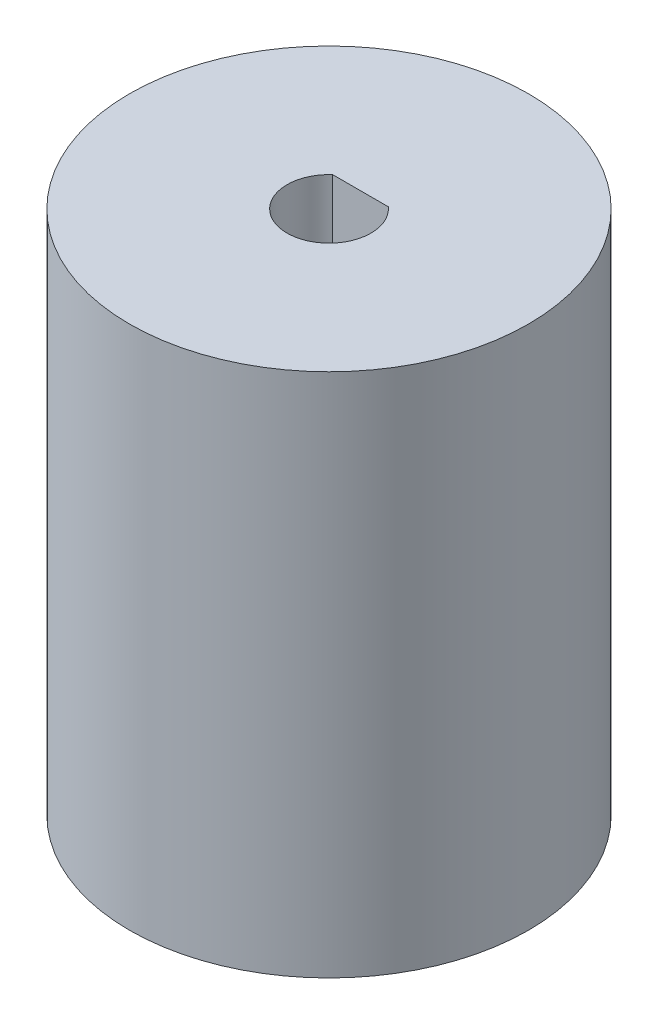
ISO-10303-21;
HEADER;
FILE_DESCRIPTION(('STEP AP214'),'2;1');
FILE_NAME('part.step','',(''),(''),'','','');
FILE_SCHEMA(('AUTOMOTIVE_DESIGN { 1 0 10303 214 1 1 1 1 }'));
ENDSEC;
DATA;
#1=APPLICATION_CONTEXT('core data for automotive mechanical design processes');
#2=APPLICATION_PROTOCOL_DEFINITION('international standard','automotive_design',2000,#1);
#3=PRODUCT_CONTEXT('',#1,'mechanical');
#4=PRODUCT('Part','Part','',(#3));
#5=PRODUCT_RELATED_PRODUCT_CATEGORY('part','',(#4));
#6=PRODUCT_DEFINITION_FORMATION('','',#4);
#7=PRODUCT_DEFINITION_CONTEXT('part definition',#1,'design');
#8=PRODUCT_DEFINITION('design','',#6,#7);
#9=PRODUCT_DEFINITION_SHAPE('','',#8);
#10=(LENGTH_UNIT() NAMED_UNIT(*) SI_UNIT(.MILLI.,.METRE.));
#11=(NAMED_UNIT(*) PLANE_ANGLE_UNIT() SI_UNIT($,.RADIAN.));
#12=(NAMED_UNIT(*) SI_UNIT($,.STERADIAN.) SOLID_ANGLE_UNIT());
#13=UNCERTAINTY_MEASURE_WITH_UNIT(LENGTH_MEASURE(1.E-05),#10,'distance_accuracy_value','');
#14=(GEOMETRIC_REPRESENTATION_CONTEXT(3) GLOBAL_UNCERTAINTY_ASSIGNED_CONTEXT((#13)) GLOBAL_UNIT_ASSIGNED_CONTEXT((#10,
#11,#12)) REPRESENTATION_CONTEXT('',''));
#15=CARTESIAN_POINT('',(0.,0.,0.));
#16=DIRECTION('',(0.,0.,1.));
#17=DIRECTION('',(1.,0.,0.));
#18=AXIS2_PLACEMENT_3D('',#15,#16,#17);
#19=CARTESIAN_POINT('',(-9.5,0.,0.));
#20=DIRECTION('',(0.,-1.,0.));
#21=DIRECTION('',(1.,0.,0.));
#22=AXIS2_PLACEMENT_3D('',#19,#20,#21);
#23=PLANE('',#22);
#24=CARTESIAN_POINT('',(0.,0.,0.));
#25=DIRECTION('',(0.,1.,0.));
#26=DIRECTION('',(-1.,0.,0.));
#27=AXIS2_PLACEMENT_3D('',#24,#25,#26);
#28=CIRCLE('',#27,4.);
#29=CARTESIAN_POINT('',(-4.,0.,0.));
#30=VERTEX_POINT('',#29);
#31=EDGE_CURVE('E11',#30,#30,#28,.T.);
#32=ORIENTED_EDGE('',*,*,#31,.T.);
#33=EDGE_LOOP('',(#32));
#34=FACE_BOUND('',#33,.T.);
#35=CARTESIAN_POINT('',(0.,0.,0.));
#36=DIRECTION('',(0.,1.,0.));
#37=DIRECTION('',(-1.,0.,0.));
#38=AXIS2_PLACEMENT_3D('',#35,#36,#37);
#39=CIRCLE('',#38,9.5);
#40=CARTESIAN_POINT('',(-9.5,0.,0.));
#41=VERTEX_POINT('',#40);
#42=EDGE_CURVE('E70',#41,#41,#39,.T.);
#43=ORIENTED_EDGE('',*,*,#42,.F.);
#44=EDGE_LOOP('',(#43));
#45=FACE_BOUND('',#44,.T.);
#46=ADVANCED_FACE('F33',(#34,#45),#23,.T.);
#47=CARTESIAN_POINT('',(0.,0.,0.));
#48=DIRECTION('',(0.,1.,0.));
#49=DIRECTION('',(-1.,0.,0.));
#50=AXIS2_PLACEMENT_3D('',#47,#48,#49);
#51=CYLINDRICAL_SURFACE('',#50,4.);
#52=CARTESIAN_POINT('',(0.,18.,0.));
#53=DIRECTION('',(0.,1.,0.));
#54=DIRECTION('',(-1.,0.,0.));
#55=AXIS2_PLACEMENT_3D('',#52,#53,#54);
#56=CIRCLE('',#55,4.);
#57=CARTESIAN_POINT('',(-4.,18.,0.));
#58=VERTEX_POINT('',#57);
#59=EDGE_CURVE('E40',#58,#58,#56,.T.);
#60=ORIENTED_EDGE('',*,*,#59,.T.);
#61=EDGE_LOOP('',(#60));
#62=FACE_BOUND('',#61,.T.);
#63=ORIENTED_EDGE('',*,*,#31,.F.);
#64=EDGE_LOOP('',(#63));
#65=FACE_BOUND('',#64,.T.);
#66=ADVANCED_FACE('F85',(#62,#65),#51,.F.);
#67=CARTESIAN_POINT('',(-4.,18.,0.));
#68=DIRECTION('',(0.,-1.,0.));
#69=DIRECTION('',(1.,0.,0.));
#70=AXIS2_PLACEMENT_3D('',#67,#68,#69);
#71=PLANE('',#70);
#72=CARTESIAN_POINT('',(0.,18.,0.));
#73=DIRECTION('',(0.,1.,0.));
#74=DIRECTION('',(-1.,0.,0.));
#75=AXIS2_PLACEMENT_3D('',#72,#73,#74);
#76=CIRCLE('',#75,2.);
#77=CARTESIAN_POINT('',(-1.3228756555323,18.,-1.5));
#78=VERTEX_POINT('',#77);
#79=CARTESIAN_POINT('',(1.32287565553229,18.,-1.5));
#80=VERTEX_POINT('',#79);
#81=EDGE_CURVE('E47',#78,#80,#76,.T.);
#82=ORIENTED_EDGE('',*,*,#81,.T.);
#83=DIRECTION('',(1.,0.,0.));
#84=VECTOR('',#83,1.);
#85=CARTESIAN_POINT('',(-1.3228756555323,18.,-1.5));
#86=LINE('',#85,#84);
#87=EDGE_CURVE('E73',#78,#80,#86,.T.);
#88=ORIENTED_EDGE('',*,*,#87,.F.);
#89=EDGE_LOOP('',(#82,#88));
#90=FACE_BOUND('',#89,.T.);
#91=ORIENTED_EDGE('',*,*,#59,.F.);
#92=EDGE_LOOP('',(#91));
#93=FACE_BOUND('',#92,.T.);
#94=ADVANCED_FACE('F88',(#90,#93),#71,.T.);
#95=CARTESIAN_POINT('',(0.,0.,0.));
#96=DIRECTION('',(0.,1.,0.));
#97=DIRECTION('',(-1.,0.,0.));
#98=AXIS2_PLACEMENT_3D('',#95,#96,#97);
#99=CYLINDRICAL_SURFACE('',#98,2.);
#100=DIRECTION('',(0.,1.,0.));
#101=VECTOR('',#100,1.);
#102=CARTESIAN_POINT('',(1.3228756555323,15.3074175964327,-1.5));
#103=LINE('',#102,#101);
#104=CARTESIAN_POINT('',(1.32287565553229,25.,-1.5));
#105=VERTEX_POINT('',#104);
#106=EDGE_CURVE('E52',#80,#105,#103,.T.);
#107=ORIENTED_EDGE('',*,*,#106,.F.);
#108=ORIENTED_EDGE('',*,*,#81,.F.);
#109=DIRECTION('',(0.,1.,0.));
#110=VECTOR('',#109,1.);
#111=CARTESIAN_POINT('',(-1.3228756555323,15.3074175964327,-1.5));
#112=LINE('',#111,#110);
#113=CARTESIAN_POINT('',(-1.3228756555323,25.,-1.5));
#114=VERTEX_POINT('',#113);
#115=EDGE_CURVE('E66',#78,#114,#112,.T.);
#116=ORIENTED_EDGE('',*,*,#115,.T.);
#117=CARTESIAN_POINT('',(0.,25.,0.));
#118=DIRECTION('',(0.,1.,0.));
#119=DIRECTION('',(-1.,0.,0.));
#120=AXIS2_PLACEMENT_3D('',#117,#118,#119);
#121=CIRCLE('',#120,2.);
#122=EDGE_CURVE('E59',#114,#105,#121,.T.);
#123=ORIENTED_EDGE('',*,*,#122,.T.);
#124=EDGE_LOOP('',(#107,#108,#116,#123));
#125=FACE_BOUND('',#124,.T.);
#126=ADVANCED_FACE('F67',(#125),#99,.F.);
#127=CARTESIAN_POINT('',(-2.,25.,0.));
#128=DIRECTION('',(0.,1.,0.));
#129=DIRECTION('',(-1.,0.,0.));
#130=AXIS2_PLACEMENT_3D('',#127,#128,#129);
#131=PLANE('',#130);
#132=CARTESIAN_POINT('',(0.,25.,0.));
#133=DIRECTION('',(0.,1.,0.));
#134=DIRECTION('',(-1.,0.,0.));
#135=AXIS2_PLACEMENT_3D('',#132,#133,#134);
#136=CIRCLE('',#135,9.5);
#137=CARTESIAN_POINT('',(-9.5,25.,0.));
#138=VERTEX_POINT('',#137);
#139=EDGE_CURVE('E63',#138,#138,#136,.T.);
#140=ORIENTED_EDGE('',*,*,#139,.T.);
#141=EDGE_LOOP('',(#140));
#142=FACE_BOUND('',#141,.T.);
#143=ORIENTED_EDGE('',*,*,#122,.F.);
#144=DIRECTION('',(1.,0.,0.));
#145=VECTOR('',#144,1.);
#146=CARTESIAN_POINT('',(-1.3228756555323,25.,-1.5));
#147=LINE('',#146,#145);
#148=EDGE_CURVE('E62',#114,#105,#147,.T.);
#149=ORIENTED_EDGE('',*,*,#148,.T.);
#150=EDGE_LOOP('',(#143,#149));
#151=FACE_BOUND('',#150,.T.);
#152=ADVANCED_FACE('F60',(#142,#151),#131,.T.);
#153=CARTESIAN_POINT('',(0.,0.,0.));
#154=DIRECTION('',(0.,1.,0.));
#155=DIRECTION('',(-1.,0.,0.));
#156=AXIS2_PLACEMENT_3D('',#153,#154,#155);
#157=CYLINDRICAL_SURFACE('',#156,9.5);
#158=ORIENTED_EDGE('',*,*,#42,.T.);
#159=EDGE_LOOP('',(#158));
#160=FACE_BOUND('',#159,.T.);
#161=ORIENTED_EDGE('',*,*,#139,.F.);
#162=EDGE_LOOP('',(#161));
#163=FACE_BOUND('',#162,.T.);
#164=ADVANCED_FACE('F107',(#160,#163),#157,.T.);
#165=CARTESIAN_POINT('',(-1.3228756555323,15.3074175964327,-1.5));
#166=DIRECTION('',(0.,0.,1.));
#167=DIRECTION('',(1.,0.,0.));
#168=AXIS2_PLACEMENT_3D('',#165,#166,#167);
#169=PLANE('',#168);
#170=ORIENTED_EDGE('',*,*,#115,.F.);
#171=ORIENTED_EDGE('',*,*,#87,.T.);
#172=ORIENTED_EDGE('',*,*,#106,.T.);
#173=ORIENTED_EDGE('',*,*,#148,.F.);
#174=EDGE_LOOP('',(#170,#171,#172,#173));
#175=FACE_BOUND('',#174,.T.);
#176=ADVANCED_FACE('F72',(#175),#169,.T.);
#177=CLOSED_SHELL('',(#46,#66,#94,#126,#152,#164,#176));
#178=MANIFOLD_SOLID_BREP('B2',#177);
#179=ADVANCED_BREP_SHAPE_REPRESENTATION('',(#18,#178),#14);
#180=SHAPE_DEFINITION_REPRESENTATION(#9,#179);
ENDSEC;
END-ISO-10303-21;
